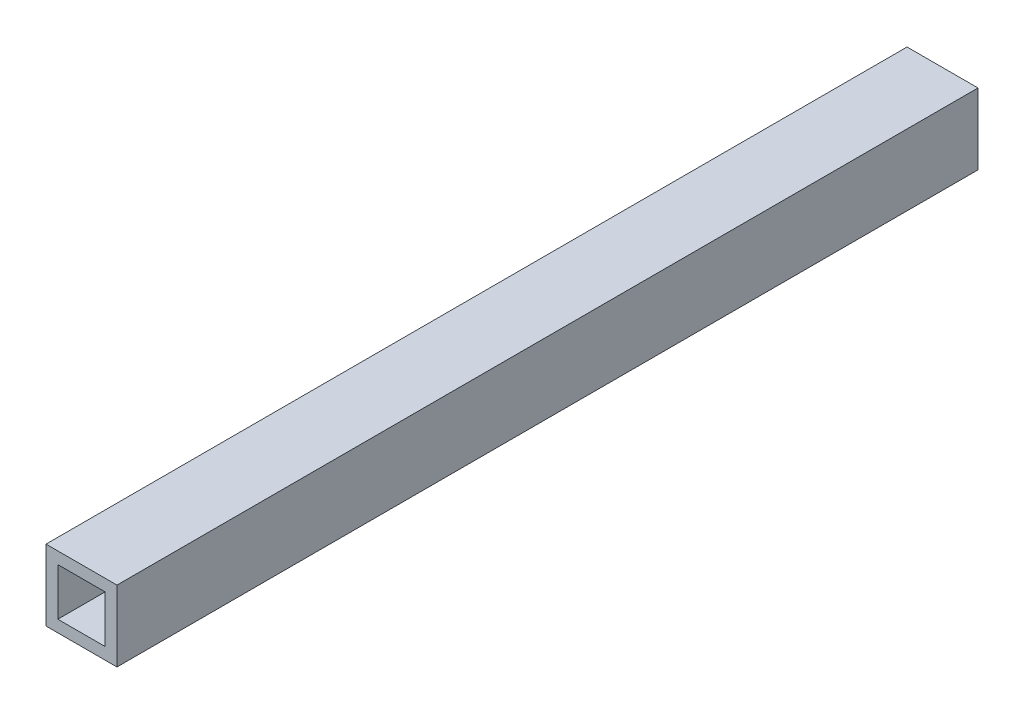
ISO-10303-21;
HEADER;
FILE_DESCRIPTION(('STEP AP214'),'2;1');
FILE_NAME('part.step','',(''),(''),'','','');
FILE_SCHEMA(('AUTOMOTIVE_DESIGN { 1 0 10303 214 1 1 1 1 }'));
ENDSEC;
DATA;
#1=APPLICATION_CONTEXT('core data for automotive mechanical design processes');
#2=APPLICATION_PROTOCOL_DEFINITION('international standard','automotive_design',2000,#1);
#3=PRODUCT_CONTEXT('',#1,'mechanical');
#4=PRODUCT('Part','Part','',(#3));
#5=PRODUCT_RELATED_PRODUCT_CATEGORY('part','',(#4));
#6=PRODUCT_DEFINITION_FORMATION('','',#4);
#7=PRODUCT_DEFINITION_CONTEXT('part definition',#1,'design');
#8=PRODUCT_DEFINITION('design','',#6,#7);
#9=PRODUCT_DEFINITION_SHAPE('','',#8);
#10=(LENGTH_UNIT() NAMED_UNIT(*) SI_UNIT(.MILLI.,.METRE.));
#11=(NAMED_UNIT(*) PLANE_ANGLE_UNIT() SI_UNIT($,.RADIAN.));
#12=(NAMED_UNIT(*) SI_UNIT($,.STERADIAN.) SOLID_ANGLE_UNIT());
#13=UNCERTAINTY_MEASURE_WITH_UNIT(LENGTH_MEASURE(1.E-05),#10,'distance_accuracy_value','');
#14=(GEOMETRIC_REPRESENTATION_CONTEXT(3) GLOBAL_UNCERTAINTY_ASSIGNED_CONTEXT((#13)) GLOBAL_UNIT_ASSIGNED_CONTEXT((#10,
#11,#12)) REPRESENTATION_CONTEXT('',''));
#15=CARTESIAN_POINT('',(0.,0.,0.));
#16=DIRECTION('',(0.,0.,1.));
#17=DIRECTION('',(1.,0.,0.));
#18=AXIS2_PLACEMENT_3D('',#15,#16,#17);
#19=CARTESIAN_POINT('',(0.,0.,231.14));
#20=DIRECTION('',(0.,0.,1.));
#21=DIRECTION('',(1.,0.,0.));
#22=AXIS2_PLACEMENT_3D('',#19,#20,#21);
#23=PLANE('',#22);
#24=DIRECTION('',(0.,-1.,0.));
#25=VECTOR('',#24,1.);
#26=CARTESIAN_POINT('',(-9.525,-9.525,231.14));
#27=LINE('',#26,#25);
#28=CARTESIAN_POINT('',(-9.525,9.525,231.14));
#29=VERTEX_POINT('',#28);
#30=CARTESIAN_POINT('',(-9.525,-9.525,231.14));
#31=VERTEX_POINT('',#30);
#32=EDGE_CURVE('E133',#29,#31,#27,.T.);
#33=ORIENTED_EDGE('',*,*,#32,.T.);
#34=DIRECTION('',(1.,0.,0.));
#35=VECTOR('',#34,1.);
#36=CARTESIAN_POINT('',(9.525,-9.525,231.14));
#37=LINE('',#36,#35);
#38=CARTESIAN_POINT('',(9.525,-9.525,231.14));
#39=VERTEX_POINT('',#38);
#40=EDGE_CURVE('E136',#31,#39,#37,.T.);
#41=ORIENTED_EDGE('',*,*,#40,.T.);
#42=DIRECTION('',(0.,1.,0.));
#43=VECTOR('',#42,1.);
#44=CARTESIAN_POINT('',(9.525,-9.525,231.14));
#45=LINE('',#44,#43);
#46=CARTESIAN_POINT('',(9.525,9.525,231.14));
#47=VERTEX_POINT('',#46);
#48=EDGE_CURVE('E139',#39,#47,#45,.T.);
#49=ORIENTED_EDGE('',*,*,#48,.T.);
#50=DIRECTION('',(-1.,0.,0.));
#51=VECTOR('',#50,1.);
#52=CARTESIAN_POINT('',(9.525,9.525,231.14));
#53=LINE('',#52,#51);
#54=EDGE_CURVE('E141',#47,#29,#53,.T.);
#55=ORIENTED_EDGE('',*,*,#54,.T.);
#56=EDGE_LOOP('',(#33,#41,#49,#55));
#57=FACE_BOUND('',#56,.T.);
#58=DIRECTION('',(1.,0.,0.));
#59=VECTOR('',#58,1.);
#60=CARTESIAN_POINT('',(6.35,-6.35,231.14));
#61=LINE('',#60,#59);
#62=CARTESIAN_POINT('',(-6.35000000000001,-6.35,231.14));
#63=VERTEX_POINT('',#62);
#64=CARTESIAN_POINT('',(6.35,-6.35,231.14));
#65=VERTEX_POINT('',#64);
#66=EDGE_CURVE('E105',#63,#65,#61,.T.);
#67=ORIENTED_EDGE('',*,*,#66,.F.);
#68=DIRECTION('',(0.,-1.,0.));
#69=VECTOR('',#68,1.);
#70=CARTESIAN_POINT('',(-6.35000000000001,-6.35,231.14));
#71=LINE('',#70,#69);
#72=CARTESIAN_POINT('',(-6.35000000000001,6.35,231.14));
#73=VERTEX_POINT('',#72);
#74=EDGE_CURVE('E97',#73,#63,#71,.T.);
#75=ORIENTED_EDGE('',*,*,#74,.F.);
#76=DIRECTION('',(-1.,0.,0.));
#77=VECTOR('',#76,1.);
#78=CARTESIAN_POINT('',(6.35,6.35,231.14));
#79=LINE('',#78,#77);
#80=CARTESIAN_POINT('',(6.35,6.35,231.14));
#81=VERTEX_POINT('',#80);
#82=EDGE_CURVE('E119',#81,#73,#79,.T.);
#83=ORIENTED_EDGE('',*,*,#82,.F.);
#84=DIRECTION('',(0.,1.,0.));
#85=VECTOR('',#84,1.);
#86=CARTESIAN_POINT('',(6.35,-6.35,231.14));
#87=LINE('',#86,#85);
#88=EDGE_CURVE('E117',#65,#81,#87,.T.);
#89=ORIENTED_EDGE('',*,*,#88,.F.);
#90=EDGE_LOOP('',(#67,#75,#83,#89));
#91=FACE_BOUND('',#90,.T.);
#92=ADVANCED_FACE('F32',(#57,#91),#23,.T.);
#93=CARTESIAN_POINT('',(0.,0.,0.));
#94=DIRECTION('',(0.,0.,1.));
#95=DIRECTION('',(1.,0.,0.));
#96=AXIS2_PLACEMENT_3D('',#93,#94,#95);
#97=PLANE('',#96);
#98=DIRECTION('',(0.,-1.,0.));
#99=VECTOR('',#98,1.);
#100=CARTESIAN_POINT('',(-9.525,-9.525,0.));
#101=LINE('',#100,#99);
#102=CARTESIAN_POINT('',(-9.525,9.525,0.));
#103=VERTEX_POINT('',#102);
#104=CARTESIAN_POINT('',(-9.525,-9.525,0.));
#105=VERTEX_POINT('',#104);
#106=EDGE_CURVE('E113',#103,#105,#101,.T.);
#107=ORIENTED_EDGE('',*,*,#106,.F.);
#108=DIRECTION('',(-1.,0.,0.));
#109=VECTOR('',#108,1.);
#110=CARTESIAN_POINT('',(9.525,9.525,0.));
#111=LINE('',#110,#109);
#112=CARTESIAN_POINT('',(9.525,9.525,0.));
#113=VERTEX_POINT('',#112);
#114=EDGE_CURVE('E137',#113,#103,#111,.T.);
#115=ORIENTED_EDGE('',*,*,#114,.F.);
#116=DIRECTION('',(0.,1.,0.));
#117=VECTOR('',#116,1.);
#118=CARTESIAN_POINT('',(9.525,-9.525,0.));
#119=LINE('',#118,#117);
#120=CARTESIAN_POINT('',(9.525,-9.525,0.));
#121=VERTEX_POINT('',#120);
#122=EDGE_CURVE('E148',#121,#113,#119,.T.);
#123=ORIENTED_EDGE('',*,*,#122,.F.);
#124=DIRECTION('',(1.,0.,0.));
#125=VECTOR('',#124,1.);
#126=CARTESIAN_POINT('',(9.525,-9.525,0.));
#127=LINE('',#126,#125);
#128=EDGE_CURVE('E146',#105,#121,#127,.T.);
#129=ORIENTED_EDGE('',*,*,#128,.F.);
#130=EDGE_LOOP('',(#107,#115,#123,#129));
#131=FACE_BOUND('',#130,.T.);
#132=DIRECTION('',(0.,-1.,0.));
#133=VECTOR('',#132,1.);
#134=CARTESIAN_POINT('',(-6.35000000000001,-6.35,0.));
#135=LINE('',#134,#133);
#136=CARTESIAN_POINT('',(-6.35000000000001,6.35,0.));
#137=VERTEX_POINT('',#136);
#138=CARTESIAN_POINT('',(-6.35000000000001,-6.35,0.));
#139=VERTEX_POINT('',#138);
#140=EDGE_CURVE('E55',#137,#139,#135,.T.);
#141=ORIENTED_EDGE('',*,*,#140,.T.);
#142=DIRECTION('',(1.,0.,0.));
#143=VECTOR('',#142,1.);
#144=CARTESIAN_POINT('',(6.35,-6.35,0.));
#145=LINE('',#144,#143);
#146=CARTESIAN_POINT('',(6.35,-6.35,0.));
#147=VERTEX_POINT('',#146);
#148=EDGE_CURVE('E112',#139,#147,#145,.T.);
#149=ORIENTED_EDGE('',*,*,#148,.T.);
#150=DIRECTION('',(0.,1.,0.));
#151=VECTOR('',#150,1.);
#152=CARTESIAN_POINT('',(6.35,-6.35,0.));
#153=LINE('',#152,#151);
#154=CARTESIAN_POINT('',(6.35,6.35,0.));
#155=VERTEX_POINT('',#154);
#156=EDGE_CURVE('E125',#147,#155,#153,.T.);
#157=ORIENTED_EDGE('',*,*,#156,.T.);
#158=DIRECTION('',(-1.,0.,0.));
#159=VECTOR('',#158,1.);
#160=CARTESIAN_POINT('',(6.35,6.35,0.));
#161=LINE('',#160,#159);
#162=EDGE_CURVE('E106',#155,#137,#161,.T.);
#163=ORIENTED_EDGE('',*,*,#162,.T.);
#164=EDGE_LOOP('',(#141,#149,#157,#163));
#165=FACE_BOUND('',#164,.T.);
#166=ADVANCED_FACE('F166',(#131,#165),#97,.F.);
#167=CARTESIAN_POINT('',(-9.525,-9.525,231.14));
#168=DIRECTION('',(1.,0.,0.));
#169=DIRECTION('',(0.,0.,-1.));
#170=AXIS2_PLACEMENT_3D('',#167,#168,#169);
#171=PLANE('',#170);
#172=ORIENTED_EDGE('',*,*,#106,.T.);
#173=DIRECTION('',(0.,0.,-1.));
#174=VECTOR('',#173,1.);
#175=CARTESIAN_POINT('',(-9.525,-9.525,231.14));
#176=LINE('',#175,#174);
#177=EDGE_CURVE('E11',#31,#105,#176,.T.);
#178=ORIENTED_EDGE('',*,*,#177,.F.);
#179=ORIENTED_EDGE('',*,*,#32,.F.);
#180=DIRECTION('',(0.,0.,-1.));
#181=VECTOR('',#180,1.);
#182=CARTESIAN_POINT('',(-9.525,9.525,231.14));
#183=LINE('',#182,#181);
#184=EDGE_CURVE('E143',#29,#103,#183,.T.);
#185=ORIENTED_EDGE('',*,*,#184,.T.);
#186=EDGE_LOOP('',(#172,#178,#179,#185));
#187=FACE_BOUND('',#186,.T.);
#188=ADVANCED_FACE('F34',(#187),#171,.F.);
#189=CARTESIAN_POINT('',(9.525,-9.525,231.14));
#190=DIRECTION('',(0.,1.,0.));
#191=DIRECTION('',(0.,0.,1.));
#192=AXIS2_PLACEMENT_3D('',#189,#190,#191);
#193=PLANE('',#192);
#194=ORIENTED_EDGE('',*,*,#128,.T.);
#195=DIRECTION('',(0.,0.,-1.));
#196=VECTOR('',#195,1.);
#197=CARTESIAN_POINT('',(9.525,-9.525,231.14));
#198=LINE('',#197,#196);
#199=EDGE_CURVE('E40',#39,#121,#198,.T.);
#200=ORIENTED_EDGE('',*,*,#199,.F.);
#201=ORIENTED_EDGE('',*,*,#40,.F.);
#202=ORIENTED_EDGE('',*,*,#177,.T.);
#203=EDGE_LOOP('',(#194,#200,#201,#202));
#204=FACE_BOUND('',#203,.T.);
#205=ADVANCED_FACE('F176',(#204),#193,.F.);
#206=CARTESIAN_POINT('',(9.525,-9.525,231.14));
#207=DIRECTION('',(-1.,0.,0.));
#208=DIRECTION('',(0.,0.,1.));
#209=AXIS2_PLACEMENT_3D('',#206,#207,#208);
#210=PLANE('',#209);
#211=ORIENTED_EDGE('',*,*,#122,.T.);
#212=DIRECTION('',(0.,0.,-1.));
#213=VECTOR('',#212,1.);
#214=CARTESIAN_POINT('',(9.525,9.525,231.14));
#215=LINE('',#214,#213);
#216=EDGE_CURVE('E153',#47,#113,#215,.T.);
#217=ORIENTED_EDGE('',*,*,#216,.F.);
#218=ORIENTED_EDGE('',*,*,#48,.F.);
#219=ORIENTED_EDGE('',*,*,#199,.T.);
#220=EDGE_LOOP('',(#211,#217,#218,#219));
#221=FACE_BOUND('',#220,.T.);
#222=ADVANCED_FACE('F160',(#221),#210,.F.);
#223=CARTESIAN_POINT('',(9.525,9.525,231.14));
#224=DIRECTION('',(0.,-1.,0.));
#225=DIRECTION('',(0.,0.,-1.));
#226=AXIS2_PLACEMENT_3D('',#223,#224,#225);
#227=PLANE('',#226);
#228=ORIENTED_EDGE('',*,*,#114,.T.);
#229=ORIENTED_EDGE('',*,*,#184,.F.);
#230=ORIENTED_EDGE('',*,*,#54,.F.);
#231=ORIENTED_EDGE('',*,*,#216,.T.);
#232=EDGE_LOOP('',(#228,#229,#230,#231));
#233=FACE_BOUND('',#232,.T.);
#234=ADVANCED_FACE('F170',(#233),#227,.F.);
#235=CARTESIAN_POINT('',(-6.35000000000001,-6.35,231.14));
#236=DIRECTION('',(1.,0.,0.));
#237=DIRECTION('',(0.,0.,-1.));
#238=AXIS2_PLACEMENT_3D('',#235,#236,#237);
#239=PLANE('',#238);
#240=ORIENTED_EDGE('',*,*,#140,.F.);
#241=DIRECTION('',(0.,0.,-1.));
#242=VECTOR('',#241,1.);
#243=CARTESIAN_POINT('',(-6.35000000000001,6.35,231.14));
#244=LINE('',#243,#242);
#245=EDGE_CURVE('E101',#73,#137,#244,.T.);
#246=ORIENTED_EDGE('',*,*,#245,.F.);
#247=ORIENTED_EDGE('',*,*,#74,.T.);
#248=DIRECTION('',(0.,0.,-1.));
#249=VECTOR('',#248,1.);
#250=CARTESIAN_POINT('',(-6.35000000000001,-6.35,231.14));
#251=LINE('',#250,#249);
#252=EDGE_CURVE('E100',#63,#139,#251,.T.);
#253=ORIENTED_EDGE('',*,*,#252,.T.);
#254=EDGE_LOOP('',(#240,#246,#247,#253));
#255=FACE_BOUND('',#254,.T.);
#256=ADVANCED_FACE('F99',(#255),#239,.T.);
#257=CARTESIAN_POINT('',(6.35,-6.35,231.14));
#258=DIRECTION('',(0.,1.,0.));
#259=DIRECTION('',(0.,0.,1.));
#260=AXIS2_PLACEMENT_3D('',#257,#258,#259);
#261=PLANE('',#260);
#262=ORIENTED_EDGE('',*,*,#148,.F.);
#263=ORIENTED_EDGE('',*,*,#252,.F.);
#264=ORIENTED_EDGE('',*,*,#66,.T.);
#265=DIRECTION('',(0.,0.,-1.));
#266=VECTOR('',#265,1.);
#267=CARTESIAN_POINT('',(6.35,-6.35,231.14));
#268=LINE('',#267,#266);
#269=EDGE_CURVE('E114',#65,#147,#268,.T.);
#270=ORIENTED_EDGE('',*,*,#269,.T.);
#271=EDGE_LOOP('',(#262,#263,#264,#270));
#272=FACE_BOUND('',#271,.T.);
#273=ADVANCED_FACE('F109',(#272),#261,.T.);
#274=CARTESIAN_POINT('',(6.35,-6.35,231.14));
#275=DIRECTION('',(-1.,0.,0.));
#276=DIRECTION('',(0.,0.,1.));
#277=AXIS2_PLACEMENT_3D('',#274,#275,#276);
#278=PLANE('',#277);
#279=ORIENTED_EDGE('',*,*,#156,.F.);
#280=ORIENTED_EDGE('',*,*,#269,.F.);
#281=ORIENTED_EDGE('',*,*,#88,.T.);
#282=DIRECTION('',(0.,0.,-1.));
#283=VECTOR('',#282,1.);
#284=CARTESIAN_POINT('',(6.35,6.35,231.14));
#285=LINE('',#284,#283);
#286=EDGE_CURVE('E47',#81,#155,#285,.T.);
#287=ORIENTED_EDGE('',*,*,#286,.T.);
#288=EDGE_LOOP('',(#279,#280,#281,#287));
#289=FACE_BOUND('',#288,.T.);
#290=ADVANCED_FACE('F199',(#289),#278,.T.);
#291=CARTESIAN_POINT('',(6.35,6.35,231.14));
#292=DIRECTION('',(0.,-1.,0.));
#293=DIRECTION('',(0.,0.,-1.));
#294=AXIS2_PLACEMENT_3D('',#291,#292,#293);
#295=PLANE('',#294);
#296=ORIENTED_EDGE('',*,*,#162,.F.);
#297=ORIENTED_EDGE('',*,*,#286,.F.);
#298=ORIENTED_EDGE('',*,*,#82,.T.);
#299=ORIENTED_EDGE('',*,*,#245,.T.);
#300=EDGE_LOOP('',(#296,#297,#298,#299));
#301=FACE_BOUND('',#300,.T.);
#302=ADVANCED_FACE('F203',(#301),#295,.T.);
#303=CLOSED_SHELL('',(#92,#166,#188,#205,#222,#234,#256,#273,#290,#302));
#304=MANIFOLD_SOLID_BREP('B2',#303);
#305=ADVANCED_BREP_SHAPE_REPRESENTATION('',(#18,#304),#14);
#306=SHAPE_DEFINITION_REPRESENTATION(#9,#305);
ENDSEC;
END-ISO-10303-21;
